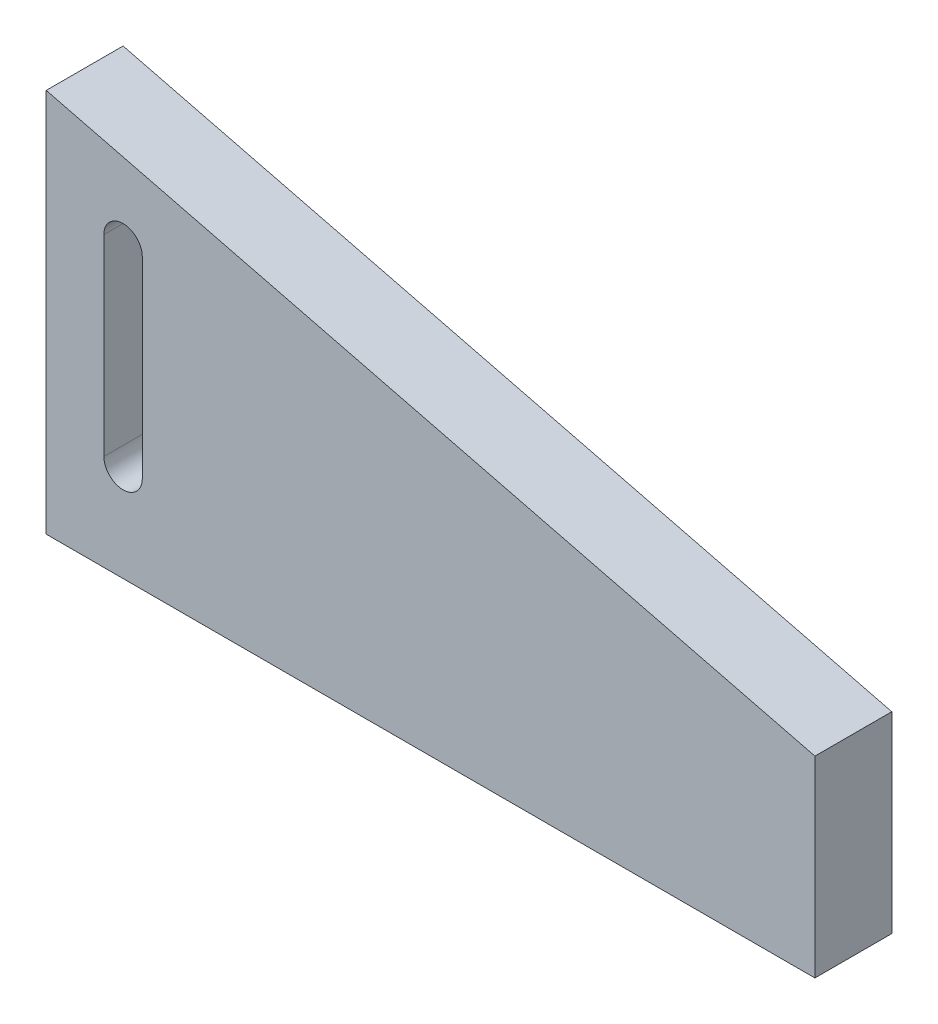
ISO-10303-21;
HEADER;
FILE_DESCRIPTION(('STEP AP214'),'2;1');
FILE_NAME('part.step','',(''),(''),'','','');
FILE_SCHEMA(('AUTOMOTIVE_DESIGN { 1 0 10303 214 1 1 1 1 }'));
ENDSEC;
DATA;
#1=APPLICATION_CONTEXT('core data for automotive mechanical design processes');
#2=APPLICATION_PROTOCOL_DEFINITION('international standard','automotive_design',2000,#1);
#3=PRODUCT_CONTEXT('',#1,'mechanical');
#4=PRODUCT('Part','Part','',(#3));
#5=PRODUCT_RELATED_PRODUCT_CATEGORY('part','',(#4));
#6=PRODUCT_DEFINITION_FORMATION('','',#4);
#7=PRODUCT_DEFINITION_CONTEXT('part definition',#1,'design');
#8=PRODUCT_DEFINITION('design','',#6,#7);
#9=PRODUCT_DEFINITION_SHAPE('','',#8);
#10=(LENGTH_UNIT() NAMED_UNIT(*) SI_UNIT(.MILLI.,.METRE.));
#11=(NAMED_UNIT(*) PLANE_ANGLE_UNIT() SI_UNIT($,.RADIAN.));
#12=(NAMED_UNIT(*) SI_UNIT($,.STERADIAN.) SOLID_ANGLE_UNIT());
#13=UNCERTAINTY_MEASURE_WITH_UNIT(LENGTH_MEASURE(1.E-05),#10,'distance_accuracy_value','');
#14=(GEOMETRIC_REPRESENTATION_CONTEXT(3) GLOBAL_UNCERTAINTY_ASSIGNED_CONTEXT((#13)) GLOBAL_UNIT_ASSIGNED_CONTEXT((#10,
#11,#12)) REPRESENTATION_CONTEXT('',''));
#15=CARTESIAN_POINT('',(0.,0.,0.));
#16=DIRECTION('',(0.,0.,1.));
#17=DIRECTION('',(1.,0.,0.));
#18=AXIS2_PLACEMENT_3D('',#15,#16,#17);
#19=CARTESIAN_POINT('',(0.,0.,10.));
#20=DIRECTION('',(0.,1.,0.));
#21=DIRECTION('',(0.,0.,1.));
#22=AXIS2_PLACEMENT_3D('',#19,#20,#21);
#23=PLANE('',#22);
#24=DIRECTION('',(1.,0.,0.));
#25=VECTOR('',#24,1.);
#26=CARTESIAN_POINT('',(0.,0.,-10.));
#27=LINE('',#26,#25);
#28=CARTESIAN_POINT('',(0.,0.,-10.));
#29=VERTEX_POINT('',#28);
#30=CARTESIAN_POINT('',(200.,0.,-10.));
#31=VERTEX_POINT('',#30);
#32=EDGE_CURVE('E129',#29,#31,#27,.T.);
#33=ORIENTED_EDGE('',*,*,#32,.T.);
#34=DIRECTION('',(0.,0.,-1.));
#35=VECTOR('',#34,1.);
#36=CARTESIAN_POINT('',(200.,0.,10.));
#37=LINE('',#36,#35);
#38=CARTESIAN_POINT('',(200.,0.,10.));
#39=VERTEX_POINT('',#38);
#40=EDGE_CURVE('E11',#39,#31,#37,.T.);
#41=ORIENTED_EDGE('',*,*,#40,.F.);
#42=DIRECTION('',(1.,0.,0.));
#43=VECTOR('',#42,1.);
#44=CARTESIAN_POINT('',(0.,0.,10.));
#45=LINE('',#44,#43);
#46=CARTESIAN_POINT('',(0.,0.,10.));
#47=VERTEX_POINT('',#46);
#48=EDGE_CURVE('E133',#47,#39,#45,.T.);
#49=ORIENTED_EDGE('',*,*,#48,.F.);
#50=DIRECTION('',(0.,0.,-1.));
#51=VECTOR('',#50,1.);
#52=CARTESIAN_POINT('',(0.,0.,10.));
#53=LINE('',#52,#51);
#54=EDGE_CURVE('E143',#47,#29,#53,.T.);
#55=ORIENTED_EDGE('',*,*,#54,.T.);
#56=EDGE_LOOP('',(#33,#41,#49,#55));
#57=FACE_BOUND('',#56,.T.);
#58=ADVANCED_FACE('F32',(#57),#23,.F.);
#59=CARTESIAN_POINT('',(200.,0.,10.));
#60=DIRECTION('',(-1.,0.,0.));
#61=DIRECTION('',(0.,0.,1.));
#62=AXIS2_PLACEMENT_3D('',#59,#60,#61);
#63=PLANE('',#62);
#64=DIRECTION('',(0.,1.,0.));
#65=VECTOR('',#64,1.);
#66=CARTESIAN_POINT('',(200.,0.,-10.));
#67=LINE('',#66,#65);
#68=CARTESIAN_POINT('',(200.,50.,-10.));
#69=VERTEX_POINT('',#68);
#70=EDGE_CURVE('E146',#31,#69,#67,.T.);
#71=ORIENTED_EDGE('',*,*,#70,.T.);
#72=DIRECTION('',(0.,0.,-1.));
#73=VECTOR('',#72,1.);
#74=CARTESIAN_POINT('',(200.,50.,10.));
#75=LINE('',#74,#73);
#76=CARTESIAN_POINT('',(200.,50.,10.));
#77=VERTEX_POINT('',#76);
#78=EDGE_CURVE('E39',#77,#69,#75,.T.);
#79=ORIENTED_EDGE('',*,*,#78,.F.);
#80=DIRECTION('',(0.,1.,0.));
#81=VECTOR('',#80,1.);
#82=CARTESIAN_POINT('',(200.,0.,10.));
#83=LINE('',#82,#81);
#84=EDGE_CURVE('E136',#39,#77,#83,.T.);
#85=ORIENTED_EDGE('',*,*,#84,.F.);
#86=ORIENTED_EDGE('',*,*,#40,.T.);
#87=EDGE_LOOP('',(#71,#79,#85,#86));
#88=FACE_BOUND('',#87,.T.);
#89=ADVANCED_FACE('F174',(#88),#63,.F.);
#90=CARTESIAN_POINT('',(200.,50.,10.));
#91=DIRECTION('',(-0.242535625036333,-0.970142500145332,0.));
#92=DIRECTION('',(0.970142500145332,-0.242535625036333,0.));
#93=AXIS2_PLACEMENT_3D('',#90,#91,#92);
#94=PLANE('',#93);
#95=DIRECTION('',(-0.970142500145332,0.242535625036333,0.));
#96=VECTOR('',#95,1.);
#97=CARTESIAN_POINT('',(200.,50.,-10.));
#98=LINE('',#97,#96);
#99=CARTESIAN_POINT('',(0.,100.,-10.));
#100=VERTEX_POINT('',#99);
#101=EDGE_CURVE('E148',#69,#100,#98,.T.);
#102=ORIENTED_EDGE('',*,*,#101,.T.);
#103=DIRECTION('',(0.,0.,-1.));
#104=VECTOR('',#103,1.);
#105=CARTESIAN_POINT('',(0.,100.,10.));
#106=LINE('',#105,#104);
#107=CARTESIAN_POINT('',(0.,100.,10.));
#108=VERTEX_POINT('',#107);
#109=EDGE_CURVE('E153',#108,#100,#106,.T.);
#110=ORIENTED_EDGE('',*,*,#109,.F.);
#111=DIRECTION('',(-0.970142500145332,0.242535625036333,0.));
#112=VECTOR('',#111,1.);
#113=CARTESIAN_POINT('',(200.,50.,10.));
#114=LINE('',#113,#112);
#115=EDGE_CURVE('E139',#77,#108,#114,.T.);
#116=ORIENTED_EDGE('',*,*,#115,.F.);
#117=ORIENTED_EDGE('',*,*,#78,.T.);
#118=EDGE_LOOP('',(#102,#110,#116,#117));
#119=FACE_BOUND('',#118,.T.);
#120=ADVANCED_FACE('F160',(#119),#94,.F.);
#121=CARTESIAN_POINT('',(0.,0.,10.));
#122=DIRECTION('',(1.,0.,0.));
#123=DIRECTION('',(0.,0.,-1.));
#124=AXIS2_PLACEMENT_3D('',#121,#122,#123);
#125=PLANE('',#124);
#126=DIRECTION('',(0.,-1.,0.));
#127=VECTOR('',#126,1.);
#128=CARTESIAN_POINT('',(0.,0.,-10.));
#129=LINE('',#128,#127);
#130=EDGE_CURVE('E137',#100,#29,#129,.T.);
#131=ORIENTED_EDGE('',*,*,#130,.T.);
#132=ORIENTED_EDGE('',*,*,#54,.F.);
#133=DIRECTION('',(0.,-1.,0.));
#134=VECTOR('',#133,1.);
#135=CARTESIAN_POINT('',(0.,0.,10.));
#136=LINE('',#135,#134);
#137=EDGE_CURVE('E141',#108,#47,#136,.T.);
#138=ORIENTED_EDGE('',*,*,#137,.F.);
#139=ORIENTED_EDGE('',*,*,#109,.T.);
#140=EDGE_LOOP('',(#131,#132,#138,#139));
#141=FACE_BOUND('',#140,.T.);
#142=ADVANCED_FACE('F167',(#141),#125,.F.);
#143=CARTESIAN_POINT('',(0.,0.,10.));
#144=DIRECTION('',(0.,0.,1.));
#145=DIRECTION('',(1.,0.,0.));
#146=AXIS2_PLACEMENT_3D('',#143,#144,#145);
#147=PLANE('',#146);
#148=CARTESIAN_POINT('',(20.,25.,10.));
#149=DIRECTION('',(0.,0.,1.));
#150=DIRECTION('',(1.,0.,0.));
#151=AXIS2_PLACEMENT_3D('',#148,#149,#150);
#152=CIRCLE('',#151,5.);
#153=CARTESIAN_POINT('',(15.,25.,10.));
#154=VERTEX_POINT('',#153);
#155=CARTESIAN_POINT('',(25.,25.,10.));
#156=VERTEX_POINT('',#155);
#157=EDGE_CURVE('E46',#154,#156,#152,.T.);
#158=ORIENTED_EDGE('',*,*,#157,.F.);
#159=DIRECTION('',(0.,-1.,0.));
#160=VECTOR('',#159,1.);
#161=CARTESIAN_POINT('',(15.,25.,10.));
#162=LINE('',#161,#160);
#163=CARTESIAN_POINT('',(15.,75.,10.));
#164=VERTEX_POINT('',#163);
#165=EDGE_CURVE('E114',#164,#154,#162,.T.);
#166=ORIENTED_EDGE('',*,*,#165,.F.);
#167=CARTESIAN_POINT('',(20.,75.,10.));
#168=DIRECTION('',(0.,0.,1.));
#169=DIRECTION('',(1.,0.,0.));
#170=AXIS2_PLACEMENT_3D('',#167,#168,#169);
#171=CIRCLE('',#170,5.);
#172=CARTESIAN_POINT('',(25.,75.,10.));
#173=VERTEX_POINT('',#172);
#174=EDGE_CURVE('E117',#173,#164,#171,.T.);
#175=ORIENTED_EDGE('',*,*,#174,.F.);
#176=DIRECTION('',(0.,1.,0.));
#177=VECTOR('',#176,1.);
#178=CARTESIAN_POINT('',(25.,25.,10.));
#179=LINE('',#178,#177);
#180=EDGE_CURVE('E123',#156,#173,#179,.T.);
#181=ORIENTED_EDGE('',*,*,#180,.F.);
#182=EDGE_LOOP('',(#158,#166,#175,#181));
#183=FACE_BOUND('',#182,.T.);
#184=ORIENTED_EDGE('',*,*,#48,.T.);
#185=ORIENTED_EDGE('',*,*,#84,.T.);
#186=ORIENTED_EDGE('',*,*,#115,.T.);
#187=ORIENTED_EDGE('',*,*,#137,.T.);
#188=EDGE_LOOP('',(#184,#185,#186,#187));
#189=FACE_BOUND('',#188,.T.);
#190=ADVANCED_FACE('F173',(#183,#189),#147,.T.);
#191=CARTESIAN_POINT('',(0.,0.,-10.));
#192=DIRECTION('',(0.,0.,1.));
#193=DIRECTION('',(1.,0.,0.));
#194=AXIS2_PLACEMENT_3D('',#191,#192,#193);
#195=PLANE('',#194);
#196=DIRECTION('',(0.,-1.,0.));
#197=VECTOR('',#196,1.);
#198=CARTESIAN_POINT('',(15.,25.,-10.));
#199=LINE('',#198,#197);
#200=CARTESIAN_POINT('',(15.,75.,-10.));
#201=VERTEX_POINT('',#200);
#202=CARTESIAN_POINT('',(15.,25.,-10.));
#203=VERTEX_POINT('',#202);
#204=EDGE_CURVE('E104',#201,#203,#199,.T.);
#205=ORIENTED_EDGE('',*,*,#204,.T.);
#206=CARTESIAN_POINT('',(20.,25.,-10.));
#207=DIRECTION('',(0.,0.,1.));
#208=DIRECTION('',(1.,0.,0.));
#209=AXIS2_PLACEMENT_3D('',#206,#207,#208);
#210=CIRCLE('',#209,5.);
#211=CARTESIAN_POINT('',(25.,25.,-10.));
#212=VERTEX_POINT('',#211);
#213=EDGE_CURVE('E98',#203,#212,#210,.T.);
#214=ORIENTED_EDGE('',*,*,#213,.T.);
#215=DIRECTION('',(0.,1.,0.));
#216=VECTOR('',#215,1.);
#217=CARTESIAN_POINT('',(25.,25.,-10.));
#218=LINE('',#217,#216);
#219=CARTESIAN_POINT('',(25.,75.,-10.));
#220=VERTEX_POINT('',#219);
#221=EDGE_CURVE('E107',#212,#220,#218,.T.);
#222=ORIENTED_EDGE('',*,*,#221,.T.);
#223=CARTESIAN_POINT('',(20.,75.,-10.));
#224=DIRECTION('',(0.,0.,1.));
#225=DIRECTION('',(1.,0.,0.));
#226=AXIS2_PLACEMENT_3D('',#223,#224,#225);
#227=CIRCLE('',#226,5.);
#228=EDGE_CURVE('E54',#220,#201,#227,.T.);
#229=ORIENTED_EDGE('',*,*,#228,.T.);
#230=EDGE_LOOP('',(#205,#214,#222,#229));
#231=FACE_BOUND('',#230,.T.);
#232=ORIENTED_EDGE('',*,*,#32,.F.);
#233=ORIENTED_EDGE('',*,*,#130,.F.);
#234=ORIENTED_EDGE('',*,*,#101,.F.);
#235=ORIENTED_EDGE('',*,*,#70,.F.);
#236=EDGE_LOOP('',(#232,#233,#234,#235));
#237=FACE_BOUND('',#236,.T.);
#238=ADVANCED_FACE('F111',(#231,#237),#195,.F.);
#239=CARTESIAN_POINT('',(20.,25.,-10.));
#240=DIRECTION('',(0.,0.,1.));
#241=DIRECTION('',(1.,0.,0.));
#242=AXIS2_PLACEMENT_3D('',#239,#240,#241);
#243=CYLINDRICAL_SURFACE('',#242,5.);
#244=ORIENTED_EDGE('',*,*,#157,.T.);
#245=DIRECTION('',(0.,0.,1.));
#246=VECTOR('',#245,1.);
#247=CARTESIAN_POINT('',(25.,25.,-10.));
#248=LINE('',#247,#246);
#249=EDGE_CURVE('E94',#212,#156,#248,.T.);
#250=ORIENTED_EDGE('',*,*,#249,.F.);
#251=ORIENTED_EDGE('',*,*,#213,.F.);
#252=DIRECTION('',(0.,0.,1.));
#253=VECTOR('',#252,1.);
#254=CARTESIAN_POINT('',(15.,25.,-10.));
#255=LINE('',#254,#253);
#256=EDGE_CURVE('E127',#203,#154,#255,.T.);
#257=ORIENTED_EDGE('',*,*,#256,.T.);
#258=EDGE_LOOP('',(#244,#250,#251,#257));
#259=FACE_BOUND('',#258,.T.);
#260=ADVANCED_FACE('F96',(#259),#243,.F.);
#261=CARTESIAN_POINT('',(15.,25.,-10.));
#262=DIRECTION('',(-1.,0.,0.));
#263=DIRECTION('',(0.,0.,1.));
#264=AXIS2_PLACEMENT_3D('',#261,#262,#263);
#265=PLANE('',#264);
#266=ORIENTED_EDGE('',*,*,#165,.T.);
#267=ORIENTED_EDGE('',*,*,#256,.F.);
#268=ORIENTED_EDGE('',*,*,#204,.F.);
#269=DIRECTION('',(0.,0.,1.));
#270=VECTOR('',#269,1.);
#271=CARTESIAN_POINT('',(15.,75.,-10.));
#272=LINE('',#271,#270);
#273=EDGE_CURVE('E130',#201,#164,#272,.T.);
#274=ORIENTED_EDGE('',*,*,#273,.T.);
#275=EDGE_LOOP('',(#266,#267,#268,#274));
#276=FACE_BOUND('',#275,.T.);
#277=ADVANCED_FACE('F191',(#276),#265,.F.);
#278=CARTESIAN_POINT('',(20.,75.,-10.));
#279=DIRECTION('',(0.,0.,1.));
#280=DIRECTION('',(1.,0.,0.));
#281=AXIS2_PLACEMENT_3D('',#278,#279,#280);
#282=CYLINDRICAL_SURFACE('',#281,5.);
#283=ORIENTED_EDGE('',*,*,#174,.T.);
#284=ORIENTED_EDGE('',*,*,#273,.F.);
#285=ORIENTED_EDGE('',*,*,#228,.F.);
#286=DIRECTION('',(0.,0.,1.));
#287=VECTOR('',#286,1.);
#288=CARTESIAN_POINT('',(25.,75.,-10.));
#289=LINE('',#288,#287);
#290=EDGE_CURVE('E103',#220,#173,#289,.T.);
#291=ORIENTED_EDGE('',*,*,#290,.T.);
#292=EDGE_LOOP('',(#283,#284,#285,#291));
#293=FACE_BOUND('',#292,.T.);
#294=ADVANCED_FACE('F194',(#293),#282,.F.);
#295=CARTESIAN_POINT('',(25.,25.,-10.));
#296=DIRECTION('',(1.,0.,0.));
#297=DIRECTION('',(0.,0.,-1.));
#298=AXIS2_PLACEMENT_3D('',#295,#296,#297);
#299=PLANE('',#298);
#300=ORIENTED_EDGE('',*,*,#180,.T.);
#301=ORIENTED_EDGE('',*,*,#290,.F.);
#302=ORIENTED_EDGE('',*,*,#221,.F.);
#303=ORIENTED_EDGE('',*,*,#249,.T.);
#304=EDGE_LOOP('',(#300,#301,#302,#303));
#305=FACE_BOUND('',#304,.T.);
#306=ADVANCED_FACE('F108',(#305),#299,.F.);
#307=CLOSED_SHELL('',(#58,#89,#120,#142,#190,#238,#260,#277,#294,#306));
#308=MANIFOLD_SOLID_BREP('B2',#307);
#309=ADVANCED_BREP_SHAPE_REPRESENTATION('',(#18,#308),#14);
#310=SHAPE_DEFINITION_REPRESENTATION(#9,#309);
ENDSEC;
END-ISO-10303-21;
